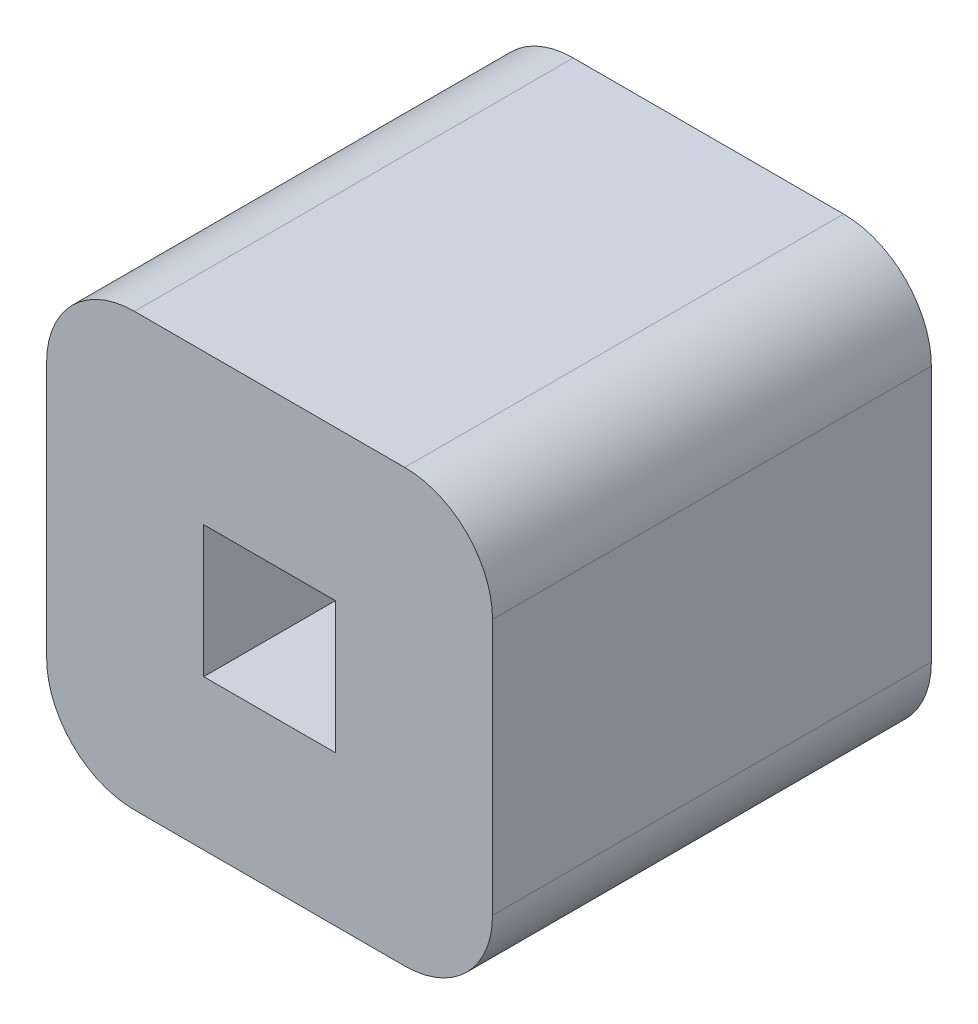
ISO-10303-21;
HEADER;
FILE_DESCRIPTION(('STEP AP214'),'2;1');
FILE_NAME('part.step','',(''),(''),'','','');
FILE_SCHEMA(('AUTOMOTIVE_DESIGN { 1 0 10303 214 1 1 1 1 }'));
ENDSEC;
DATA;
#1=APPLICATION_CONTEXT('core data for automotive mechanical design processes');
#2=APPLICATION_PROTOCOL_DEFINITION('international standard','automotive_design',2000,#1);
#3=PRODUCT_CONTEXT('',#1,'mechanical');
#4=PRODUCT('Part','Part','',(#3));
#5=PRODUCT_RELATED_PRODUCT_CATEGORY('part','',(#4));
#6=PRODUCT_DEFINITION_FORMATION('','',#4);
#7=PRODUCT_DEFINITION_CONTEXT('part definition',#1,'design');
#8=PRODUCT_DEFINITION('design','',#6,#7);
#9=PRODUCT_DEFINITION_SHAPE('','',#8);
#10=(LENGTH_UNIT() NAMED_UNIT(*) SI_UNIT(.MILLI.,.METRE.));
#11=(NAMED_UNIT(*) PLANE_ANGLE_UNIT() SI_UNIT($,.RADIAN.));
#12=(NAMED_UNIT(*) SI_UNIT($,.STERADIAN.) SOLID_ANGLE_UNIT());
#13=UNCERTAINTY_MEASURE_WITH_UNIT(LENGTH_MEASURE(1.E-05),#10,'distance_accuracy_value','');
#14=(GEOMETRIC_REPRESENTATION_CONTEXT(3) GLOBAL_UNCERTAINTY_ASSIGNED_CONTEXT((#13)) GLOBAL_UNIT_ASSIGNED_CONTEXT((#10,
#11,#12)) REPRESENTATION_CONTEXT('',''));
#15=CARTESIAN_POINT('',(0.,0.,0.));
#16=DIRECTION('',(0.,0.,1.));
#17=DIRECTION('',(1.,0.,0.));
#18=AXIS2_PLACEMENT_3D('',#15,#16,#17);
#19=CARTESIAN_POINT('',(0.960735714690616,-1.07588735959036,0.16337874015748));
#20=DIRECTION('',(0.,0.,1.));
#21=DIRECTION('',(0.,-1.,0.));
#22=AXIS2_PLACEMENT_3D('',#19,#20,#21);
#23=PLANE('',#22);
#24=DIRECTION('',(1.,0.,0.));
#25=VECTOR('',#24,1.);
#26=CARTESIAN_POINT('',(0.882389257997703,-0.966044839905316,0.16337874015748));
#27=LINE('',#26,#25);
#28=CARTESIAN_POINT('',(0.946050675320537,-0.966044839905316,0.16337874015748));
#29=VERTEX_POINT('',#28);
#30=CARTESIAN_POINT('',(0.885420754060695,-0.966044839905316,0.16337874015748));
#31=VERTEX_POINT('',#30);
#32=EDGE_CURVE('E133',#29,#31,#27,.F.);
#33=ORIENTED_EDGE('',*,*,#32,.F.);
#34=CARTESIAN_POINT('',(0.946050675320537,-0.946359800535237,0.16337874015748));
#35=DIRECTION('',(0.,0.,-1.));
#36=DIRECTION('',(0.,1.,0.));
#37=AXIS2_PLACEMENT_3D('',#34,#35,#36);
#38=CIRCLE('',#37,0.0196850393700787);
#39=CARTESIAN_POINT('',(0.965735714690616,-0.946359800535237,0.16337874015748));
#40=VERTEX_POINT('',#39);
#41=EDGE_CURVE('E160',#40,#29,#38,.T.);
#42=ORIENTED_EDGE('',*,*,#41,.F.);
#43=DIRECTION('',(0.,1.,0.));
#44=VECTOR('',#43,1.);
#45=CARTESIAN_POINT('',(0.965735714690616,-0.917619643054922,0.16337874015748));
#46=LINE('',#45,#44);
#47=CARTESIAN_POINT('',(0.965735714690616,-0.888879485574608,0.16337874015748));
#48=VERTEX_POINT('',#47);
#49=EDGE_CURVE('E130',#48,#40,#46,.F.);
#50=ORIENTED_EDGE('',*,*,#49,.F.);
#51=CARTESIAN_POINT('',(0.946050675320537,-0.888879485574608,0.16337874015748));
#52=DIRECTION('',(0.,0.,1.));
#53=DIRECTION('',(0.,-1.,0.));
#54=AXIS2_PLACEMENT_3D('',#51,#52,#53);
#55=CIRCLE('',#54,0.0196850393700787);
#56=CARTESIAN_POINT('',(0.946050675320537,-0.869194446204529,0.16337874015748));
#57=VERTEX_POINT('',#56);
#58=EDGE_CURVE('E20',#57,#48,#55,.F.);
#59=ORIENTED_EDGE('',*,*,#58,.F.);
#60=DIRECTION('',(1.,0.,0.));
#61=VECTOR('',#60,1.);
#62=CARTESIAN_POINT('',(0.882389257997703,-0.869194446204529,0.16337874015748));
#63=LINE('',#62,#61);
#64=CARTESIAN_POINT('',(0.885420754060695,-0.869194446204529,0.16337874015748));
#65=VERTEX_POINT('',#64);
#66=EDGE_CURVE('E141',#57,#65,#63,.F.);
#67=ORIENTED_EDGE('',*,*,#66,.T.);
#68=CARTESIAN_POINT('',(0.885420754060695,-0.888879485574608,0.16337874015748));
#69=DIRECTION('',(0.,0.,1.));
#70=DIRECTION('',(0.,-1.,0.));
#71=AXIS2_PLACEMENT_3D('',#68,#69,#70);
#72=CIRCLE('',#71,0.0196850393700787);
#73=CARTESIAN_POINT('',(0.865735714690616,-0.888879485574608,0.16337874015748));
#74=VERTEX_POINT('',#73);
#75=EDGE_CURVE('E143',#74,#65,#72,.F.);
#76=ORIENTED_EDGE('',*,*,#75,.F.);
#77=DIRECTION('',(0.,-1.,0.));
#78=VECTOR('',#77,1.);
#79=CARTESIAN_POINT('',(0.865735714690616,-0.781005469826576,0.16337874015748));
#80=LINE('',#79,#78);
#81=CARTESIAN_POINT('',(0.865735714690616,-0.946359800535237,0.16337874015748));
#82=VERTEX_POINT('',#81);
#83=EDGE_CURVE('E137',#82,#74,#80,.F.);
#84=ORIENTED_EDGE('',*,*,#83,.F.);
#85=CARTESIAN_POINT('',(0.885420754060695,-0.946359800535237,0.16337874015748));
#86=DIRECTION('',(0.,0.,-1.));
#87=DIRECTION('',(0.,1.,0.));
#88=AXIS2_PLACEMENT_3D('',#85,#86,#87);
#89=CIRCLE('',#88,0.0196850393700787);
#90=EDGE_CURVE('E163',#31,#82,#89,.T.);
#91=ORIENTED_EDGE('',*,*,#90,.F.);
#92=EDGE_LOOP('',(#33,#42,#50,#59,#67,#76,#84,#91));
#93=FACE_BOUND('',#92,.T.);
#94=DIRECTION('',(1.,0.,0.));
#95=VECTOR('',#94,1.);
#96=CARTESIAN_POINT('',(0.931975872170931,-0.902855863527363,0.16337874015748));
#97=LINE('',#96,#95);
#98=CARTESIAN_POINT('',(0.900971935163057,-0.902855863527363,0.16337874015748));
#99=VERTEX_POINT('',#98);
#100=CARTESIAN_POINT('',(0.930499494218175,-0.902855863527363,0.16337874015748));
#101=VERTEX_POINT('',#100);
#102=EDGE_CURVE('E107',#99,#101,#97,.T.);
#103=ORIENTED_EDGE('',*,*,#102,.T.);
#104=DIRECTION('',(0.,-1.,0.));
#105=VECTOR('',#104,1.);
#106=CARTESIAN_POINT('',(0.930499494218175,-0.901379485574607,0.16337874015748));
#107=LINE('',#106,#105);
#108=CARTESIAN_POINT('',(0.930499494218175,-0.932383422582481,0.16337874015748));
#109=VERTEX_POINT('',#108);
#110=EDGE_CURVE('E121',#109,#101,#107,.F.);
#111=ORIENTED_EDGE('',*,*,#110,.F.);
#112=DIRECTION('',(1.,0.,0.));
#113=VECTOR('',#112,1.);
#114=CARTESIAN_POINT('',(0.931975872170931,-0.932383422582481,0.16337874015748));
#115=LINE('',#114,#113);
#116=CARTESIAN_POINT('',(0.900971935163057,-0.932383422582481,0.16337874015748));
#117=VERTEX_POINT('',#116);
#118=EDGE_CURVE('E91',#117,#109,#115,.T.);
#119=ORIENTED_EDGE('',*,*,#118,.F.);
#120=DIRECTION('',(0.,1.,0.));
#121=VECTOR('',#120,1.);
#122=CARTESIAN_POINT('',(0.900971935163057,-0.933859800535237,0.16337874015748));
#123=LINE('',#122,#121);
#124=EDGE_CURVE('E105',#99,#117,#123,.F.);
#125=ORIENTED_EDGE('',*,*,#124,.F.);
#126=EDGE_LOOP('',(#103,#111,#119,#125));
#127=FACE_BOUND('',#126,.T.);
#128=ADVANCED_FACE('F17',(#93,#127),#23,.T.);
#129=CARTESIAN_POINT('',(0.900971935163057,-0.933859800535237,0.152158267716535));
#130=DIRECTION('',(1.,0.,0.));
#131=DIRECTION('',(0.,1.,0.));
#132=AXIS2_PLACEMENT_3D('',#129,#130,#131);
#133=PLANE('',#132);
#134=ORIENTED_EDGE('',*,*,#124,.T.);
#135=DIRECTION('',(0.,0.,1.));
#136=VECTOR('',#135,1.);
#137=CARTESIAN_POINT('',(0.900971935163057,-0.932383422582481,0.152158267716535));
#138=LINE('',#137,#136);
#139=CARTESIAN_POINT('',(0.900971935163057,-0.932383422582481,0.0649535433070866));
#140=VERTEX_POINT('',#139);
#141=EDGE_CURVE('E178',#140,#117,#138,.T.);
#142=ORIENTED_EDGE('',*,*,#141,.F.);
#143=DIRECTION('',(0.,-1.,0.));
#144=VECTOR('',#143,1.);
#145=CARTESIAN_POINT('',(0.900971935163057,-1.07588735959036,0.0649535433070866));
#146=LINE('',#145,#144);
#147=CARTESIAN_POINT('',(0.900971935163057,-0.902855863527363,0.0649535433070866));
#148=VERTEX_POINT('',#147);
#149=EDGE_CURVE('E126',#140,#148,#146,.F.);
#150=ORIENTED_EDGE('',*,*,#149,.T.);
#151=DIRECTION('',(0.,0.,1.));
#152=VECTOR('',#151,1.);
#153=CARTESIAN_POINT('',(0.900971935163057,-0.902855863527363,0.152158267716535));
#154=LINE('',#153,#152);
#155=EDGE_CURVE('E112',#148,#99,#154,.T.);
#156=ORIENTED_EDGE('',*,*,#155,.T.);
#157=EDGE_LOOP('',(#134,#142,#150,#156));
#158=FACE_BOUND('',#157,.T.);
#159=ADVANCED_FACE('F124',(#158),#133,.T.);
#160=CARTESIAN_POINT('',(0.931975872170931,-0.902855863527363,0.152158267716535));
#161=DIRECTION('',(0.,1.,0.));
#162=DIRECTION('',(0.,0.,1.));
#163=AXIS2_PLACEMENT_3D('',#160,#161,#162);
#164=PLANE('',#163);
#165=DIRECTION('',(0.,0.,1.));
#166=VECTOR('',#165,1.);
#167=CARTESIAN_POINT('',(0.930499494218175,-0.902855863527363,0.152158267716535));
#168=LINE('',#167,#166);
#169=CARTESIAN_POINT('',(0.930499494218175,-0.902855863527363,0.0649535433070866));
#170=VERTEX_POINT('',#169);
#171=EDGE_CURVE('E120',#101,#170,#168,.F.);
#172=ORIENTED_EDGE('',*,*,#171,.F.);
#173=ORIENTED_EDGE('',*,*,#102,.F.);
#174=ORIENTED_EDGE('',*,*,#155,.F.);
#175=DIRECTION('',(1.,0.,0.));
#176=VECTOR('',#175,1.);
#177=CARTESIAN_POINT('',(0.960735714690616,-0.902855863527363,0.0649535433070866));
#178=LINE('',#177,#176);
#179=EDGE_CURVE('E194',#148,#170,#178,.T.);
#180=ORIENTED_EDGE('',*,*,#179,.T.);
#181=EDGE_LOOP('',(#172,#173,#174,#180));
#182=FACE_BOUND('',#181,.T.);
#183=ADVANCED_FACE('F116',(#182),#164,.F.);
#184=CARTESIAN_POINT('',(0.930499494218175,-0.901379485574607,0.152158267716535));
#185=DIRECTION('',(-1.,0.,0.));
#186=DIRECTION('',(0.,-1.,0.));
#187=AXIS2_PLACEMENT_3D('',#184,#185,#186);
#188=PLANE('',#187);
#189=ORIENTED_EDGE('',*,*,#110,.T.);
#190=ORIENTED_EDGE('',*,*,#171,.T.);
#191=DIRECTION('',(0.,-1.,0.));
#192=VECTOR('',#191,1.);
#193=CARTESIAN_POINT('',(0.930499494218175,-1.07588735959036,0.0649535433070866));
#194=LINE('',#193,#192);
#195=CARTESIAN_POINT('',(0.930499494218175,-0.932383422582481,0.0649535433070866));
#196=VERTEX_POINT('',#195);
#197=EDGE_CURVE('E186',#170,#196,#194,.T.);
#198=ORIENTED_EDGE('',*,*,#197,.T.);
#199=DIRECTION('',(0.,0.,1.));
#200=VECTOR('',#199,1.);
#201=CARTESIAN_POINT('',(0.930499494218175,-0.932383422582481,0.152158267716535));
#202=LINE('',#201,#200);
#203=EDGE_CURVE('E175',#109,#196,#202,.F.);
#204=ORIENTED_EDGE('',*,*,#203,.F.);
#205=EDGE_LOOP('',(#189,#190,#198,#204));
#206=FACE_BOUND('',#205,.T.);
#207=ADVANCED_FACE('F182',(#206),#188,.T.);
#208=CARTESIAN_POINT('',(0.931975872170931,-0.932383422582481,0.152158267716535));
#209=DIRECTION('',(0.,1.,0.));
#210=DIRECTION('',(0.,0.,1.));
#211=AXIS2_PLACEMENT_3D('',#208,#209,#210);
#212=PLANE('',#211);
#213=ORIENTED_EDGE('',*,*,#118,.T.);
#214=ORIENTED_EDGE('',*,*,#203,.T.);
#215=DIRECTION('',(1.,0.,0.));
#216=VECTOR('',#215,1.);
#217=CARTESIAN_POINT('',(0.960735714690616,-0.932383422582481,0.0649535433070866));
#218=LINE('',#217,#216);
#219=EDGE_CURVE('E159',#196,#140,#218,.F.);
#220=ORIENTED_EDGE('',*,*,#219,.T.);
#221=ORIENTED_EDGE('',*,*,#141,.T.);
#222=EDGE_LOOP('',(#213,#214,#220,#221));
#223=FACE_BOUND('',#222,.T.);
#224=ADVANCED_FACE('F189',(#223),#212,.T.);
#225=CARTESIAN_POINT('',(0.946050675320537,-0.888879485574608,0.1683));
#226=DIRECTION('',(0.,0.,1.));
#227=DIRECTION('',(0.,-1.,0.));
#228=AXIS2_PLACEMENT_3D('',#225,#226,#227);
#229=CYLINDRICAL_SURFACE('',#228,0.0196850393700787);
#230=ORIENTED_EDGE('',*,*,#58,.T.);
#231=DIRECTION('',(0.,0.,1.));
#232=VECTOR('',#231,1.);
#233=CARTESIAN_POINT('',(0.965735714690616,-0.888879485574607,0.114166141732283));
#234=LINE('',#233,#232);
#235=CARTESIAN_POINT('',(0.965735714690616,-0.888879485574608,0.0649535433070866));
#236=VERTEX_POINT('',#235);
#237=EDGE_CURVE('E132',#236,#48,#234,.T.);
#238=ORIENTED_EDGE('',*,*,#237,.F.);
#239=CARTESIAN_POINT('',(0.946050675320537,-0.888879485574608,0.0649535433070866));
#240=DIRECTION('',(0.,0.,1.));
#241=DIRECTION('',(0.,-1.,0.));
#242=AXIS2_PLACEMENT_3D('',#239,#240,#241);
#243=CIRCLE('',#242,0.0196850393700787);
#244=CARTESIAN_POINT('',(0.946050675320537,-0.869194446204529,0.0649535433070866));
#245=VERTEX_POINT('',#244);
#246=EDGE_CURVE('E156',#236,#245,#243,.T.);
#247=ORIENTED_EDGE('',*,*,#246,.T.);
#248=DIRECTION('',(0.,0.,-1.));
#249=VECTOR('',#248,1.);
#250=CARTESIAN_POINT('',(0.946050675320537,-0.869194446204529,0.0600322834645669));
#251=LINE('',#250,#249);
#252=EDGE_CURVE('E144',#245,#57,#251,.F.);
#253=ORIENTED_EDGE('',*,*,#252,.T.);
#254=EDGE_LOOP('',(#230,#238,#247,#253));
#255=FACE_BOUND('',#254,.T.);
#256=ADVANCED_FACE('F232',(#255),#229,.T.);
#257=CARTESIAN_POINT('',(0.882389257997703,-0.869194446204529,0.0600322834645669));
#258=DIRECTION('',(0.,-1.,0.));
#259=DIRECTION('',(0.,0.,-1.));
#260=AXIS2_PLACEMENT_3D('',#257,#258,#259);
#261=PLANE('',#260);
#262=DIRECTION('',(0.,0.,1.));
#263=VECTOR('',#262,1.);
#264=CARTESIAN_POINT('',(0.885420754060695,-0.869194446204529,0.1683));
#265=LINE('',#264,#263);
#266=CARTESIAN_POINT('',(0.885420754060695,-0.869194446204529,0.0649535433070866));
#267=VERTEX_POINT('',#266);
#268=EDGE_CURVE('E140',#65,#267,#265,.F.);
#269=ORIENTED_EDGE('',*,*,#268,.F.);
#270=ORIENTED_EDGE('',*,*,#66,.F.);
#271=ORIENTED_EDGE('',*,*,#252,.F.);
#272=DIRECTION('',(1.,0.,0.));
#273=VECTOR('',#272,1.);
#274=CARTESIAN_POINT('',(0.960735714690616,-0.869194446204529,0.0649535433070866));
#275=LINE('',#274,#273);
#276=EDGE_CURVE('E155',#245,#267,#275,.F.);
#277=ORIENTED_EDGE('',*,*,#276,.T.);
#278=EDGE_LOOP('',(#269,#270,#271,#277));
#279=FACE_BOUND('',#278,.T.);
#280=ADVANCED_FACE('F230',(#279),#261,.F.);
#281=CARTESIAN_POINT('',(0.885420754060695,-0.888879485574608,0.1683));
#282=DIRECTION('',(0.,0.,1.));
#283=DIRECTION('',(0.,-1.,0.));
#284=AXIS2_PLACEMENT_3D('',#281,#282,#283);
#285=CYLINDRICAL_SURFACE('',#284,0.0196850393700787);
#286=ORIENTED_EDGE('',*,*,#75,.T.);
#287=ORIENTED_EDGE('',*,*,#268,.T.);
#288=CARTESIAN_POINT('',(0.885420754060695,-0.888879485574608,0.0649535433070866));
#289=DIRECTION('',(0.,0.,1.));
#290=DIRECTION('',(0.,-1.,0.));
#291=AXIS2_PLACEMENT_3D('',#288,#289,#290);
#292=CIRCLE('',#291,0.0196850393700787);
#293=CARTESIAN_POINT('',(0.865735714690616,-0.888879485574608,0.0649535433070866));
#294=VERTEX_POINT('',#293);
#295=EDGE_CURVE('E152',#267,#294,#292,.T.);
#296=ORIENTED_EDGE('',*,*,#295,.T.);
#297=DIRECTION('',(0.,0.,1.));
#298=VECTOR('',#297,1.);
#299=CARTESIAN_POINT('',(0.865735714690616,-0.888879485574608,0.0600322834645669));
#300=LINE('',#299,#298);
#301=EDGE_CURVE('E139',#74,#294,#300,.F.);
#302=ORIENTED_EDGE('',*,*,#301,.F.);
#303=EDGE_LOOP('',(#286,#287,#296,#302));
#304=FACE_BOUND('',#303,.T.);
#305=ADVANCED_FACE('F226',(#304),#285,.T.);
#306=CARTESIAN_POINT('',(0.865735714690616,-0.781005469826576,0.0600322834645669));
#307=DIRECTION('',(-1.,0.,0.));
#308=DIRECTION('',(0.,-1.,0.));
#309=AXIS2_PLACEMENT_3D('',#306,#307,#308);
#310=PLANE('',#309);
#311=DIRECTION('',(0.,-1.,0.));
#312=VECTOR('',#311,1.);
#313=CARTESIAN_POINT('',(0.865735714690616,-1.07588735959036,0.0649535433070866));
#314=LINE('',#313,#312);
#315=CARTESIAN_POINT('',(0.865735714690616,-0.946359800535237,0.0649535433070866));
#316=VERTEX_POINT('',#315);
#317=EDGE_CURVE('E151',#294,#316,#314,.T.);
#318=ORIENTED_EDGE('',*,*,#317,.T.);
#319=DIRECTION('',(0.,0.,-1.));
#320=VECTOR('',#319,1.);
#321=CARTESIAN_POINT('',(0.865735714690616,-0.946359800535237,0.1683));
#322=LINE('',#321,#320);
#323=EDGE_CURVE('E136',#82,#316,#322,.T.);
#324=ORIENTED_EDGE('',*,*,#323,.F.);
#325=ORIENTED_EDGE('',*,*,#83,.T.);
#326=ORIENTED_EDGE('',*,*,#301,.T.);
#327=EDGE_LOOP('',(#318,#324,#325,#326));
#328=FACE_BOUND('',#327,.T.);
#329=ADVANCED_FACE('F219',(#328),#310,.T.);
#330=CARTESIAN_POINT('',(0.885420754060695,-0.946359800535237,0.1683));
#331=DIRECTION('',(0.,0.,-1.));
#332=DIRECTION('',(0.,1.,0.));
#333=AXIS2_PLACEMENT_3D('',#330,#331,#332);
#334=CYLINDRICAL_SURFACE('',#333,0.0196850393700787);
#335=ORIENTED_EDGE('',*,*,#90,.T.);
#336=ORIENTED_EDGE('',*,*,#323,.T.);
#337=CARTESIAN_POINT('',(0.885420754060695,-0.946359800535237,0.0649535433070866));
#338=DIRECTION('',(0.,0.,-1.));
#339=DIRECTION('',(0.,1.,0.));
#340=AXIS2_PLACEMENT_3D('',#337,#338,#339);
#341=CIRCLE('',#340,0.0196850393700787);
#342=CARTESIAN_POINT('',(0.885420754060695,-0.966044839905316,0.0649535433070866));
#343=VERTEX_POINT('',#342);
#344=EDGE_CURVE('E148',#316,#343,#341,.F.);
#345=ORIENTED_EDGE('',*,*,#344,.T.);
#346=DIRECTION('',(0.,0.,-1.));
#347=VECTOR('',#346,1.);
#348=CARTESIAN_POINT('',(0.885420754060695,-0.966044839905316,0.0600322834645669));
#349=LINE('',#348,#347);
#350=EDGE_CURVE('E135',#31,#343,#349,.T.);
#351=ORIENTED_EDGE('',*,*,#350,.F.);
#352=EDGE_LOOP('',(#335,#336,#345,#351));
#353=FACE_BOUND('',#352,.T.);
#354=ADVANCED_FACE('F208',(#353),#334,.T.);
#355=CARTESIAN_POINT('',(0.882389257997703,-0.966044839905316,0.0600322834645669));
#356=DIRECTION('',(0.,-1.,0.));
#357=DIRECTION('',(0.,0.,-1.));
#358=AXIS2_PLACEMENT_3D('',#355,#356,#357);
#359=PLANE('',#358);
#360=ORIENTED_EDGE('',*,*,#32,.T.);
#361=ORIENTED_EDGE('',*,*,#350,.T.);
#362=DIRECTION('',(1.,0.,0.));
#363=VECTOR('',#362,1.);
#364=CARTESIAN_POINT('',(0.960735714690616,-0.966044839905316,0.0649535433070866));
#365=LINE('',#364,#363);
#366=CARTESIAN_POINT('',(0.946050675320537,-0.966044839905316,0.0649535433070866));
#367=VERTEX_POINT('',#366);
#368=EDGE_CURVE('E147',#343,#367,#365,.T.);
#369=ORIENTED_EDGE('',*,*,#368,.T.);
#370=DIRECTION('',(0.,0.,-1.));
#371=VECTOR('',#370,1.);
#372=CARTESIAN_POINT('',(0.946050675320537,-0.966044839905316,0.1683));
#373=LINE('',#372,#371);
#374=EDGE_CURVE('E162',#29,#367,#373,.T.);
#375=ORIENTED_EDGE('',*,*,#374,.F.);
#376=EDGE_LOOP('',(#360,#361,#369,#375));
#377=FACE_BOUND('',#376,.T.);
#378=ADVANCED_FACE('F223',(#377),#359,.T.);
#379=CARTESIAN_POINT('',(0.946050675320537,-0.946359800535237,0.1683));
#380=DIRECTION('',(0.,0.,-1.));
#381=DIRECTION('',(0.,1.,0.));
#382=AXIS2_PLACEMENT_3D('',#379,#380,#381);
#383=CYLINDRICAL_SURFACE('',#382,0.0196850393700787);
#384=ORIENTED_EDGE('',*,*,#41,.T.);
#385=ORIENTED_EDGE('',*,*,#374,.T.);
#386=CARTESIAN_POINT('',(0.946050675320537,-0.946359800535237,0.0649535433070866));
#387=DIRECTION('',(0.,0.,-1.));
#388=DIRECTION('',(0.,1.,0.));
#389=AXIS2_PLACEMENT_3D('',#386,#387,#388);
#390=CIRCLE('',#389,0.0196850393700787);
#391=CARTESIAN_POINT('',(0.965735714690616,-0.946359800535237,0.0649535433070866));
#392=VERTEX_POINT('',#391);
#393=EDGE_CURVE('E26',#367,#392,#390,.F.);
#394=ORIENTED_EDGE('',*,*,#393,.T.);
#395=DIRECTION('',(0.,0.,1.));
#396=VECTOR('',#395,1.);
#397=CARTESIAN_POINT('',(0.965735714690616,-0.946359800535237,0.114166141732283));
#398=LINE('',#397,#396);
#399=EDGE_CURVE('E34',#40,#392,#398,.F.);
#400=ORIENTED_EDGE('',*,*,#399,.F.);
#401=EDGE_LOOP('',(#384,#385,#394,#400));
#402=FACE_BOUND('',#401,.T.);
#403=ADVANCED_FACE('F235',(#402),#383,.T.);
#404=CARTESIAN_POINT('',(0.965735714690616,-0.917619643054922,0.114166141732283));
#405=DIRECTION('',(1.,0.,0.));
#406=DIRECTION('',(0.,1.,0.));
#407=AXIS2_PLACEMENT_3D('',#404,#405,#406);
#408=PLANE('',#407);
#409=ORIENTED_EDGE('',*,*,#49,.T.);
#410=ORIENTED_EDGE('',*,*,#399,.T.);
#411=DIRECTION('',(0.,-1.,0.));
#412=VECTOR('',#411,1.);
#413=CARTESIAN_POINT('',(0.965735714690616,-1.07588735959036,0.0649535433070866));
#414=LINE('',#413,#412);
#415=EDGE_CURVE('E11',#392,#236,#414,.F.);
#416=ORIENTED_EDGE('',*,*,#415,.T.);
#417=ORIENTED_EDGE('',*,*,#237,.T.);
#418=EDGE_LOOP('',(#409,#410,#416,#417));
#419=FACE_BOUND('',#418,.T.);
#420=ADVANCED_FACE('F236',(#419),#408,.T.);
#421=CARTESIAN_POINT('',(0.960735714690616,-1.07588735959036,0.0649535433070866));
#422=DIRECTION('',(0.,0.,1.));
#423=DIRECTION('',(0.,-1.,0.));
#424=AXIS2_PLACEMENT_3D('',#421,#422,#423);
#425=PLANE('',#424);
#426=ORIENTED_EDGE('',*,*,#393,.F.);
#427=ORIENTED_EDGE('',*,*,#368,.F.);
#428=ORIENTED_EDGE('',*,*,#344,.F.);
#429=ORIENTED_EDGE('',*,*,#317,.F.);
#430=ORIENTED_EDGE('',*,*,#295,.F.);
#431=ORIENTED_EDGE('',*,*,#276,.F.);
#432=ORIENTED_EDGE('',*,*,#246,.F.);
#433=ORIENTED_EDGE('',*,*,#415,.F.);
#434=EDGE_LOOP('',(#426,#427,#428,#429,#430,#431,#432,#433));
#435=FACE_BOUND('',#434,.T.);
#436=ORIENTED_EDGE('',*,*,#197,.F.);
#437=ORIENTED_EDGE('',*,*,#179,.F.);
#438=ORIENTED_EDGE('',*,*,#149,.F.);
#439=ORIENTED_EDGE('',*,*,#219,.F.);
#440=EDGE_LOOP('',(#436,#437,#438,#439));
#441=FACE_BOUND('',#440,.T.);
#442=ADVANCED_FACE('F192',(#435,#441),#425,.F.);
#443=CLOSED_SHELL('',(#128,#159,#183,#207,#224,#256,#280,#305,#329,#354,#378,#403,#420,#442));
#444=MANIFOLD_SOLID_BREP('B1',#443);
#445=ADVANCED_BREP_SHAPE_REPRESENTATION('',(#18,#444),#14);
#446=SHAPE_DEFINITION_REPRESENTATION(#9,#445);
ENDSEC;
END-ISO-10303-21;
